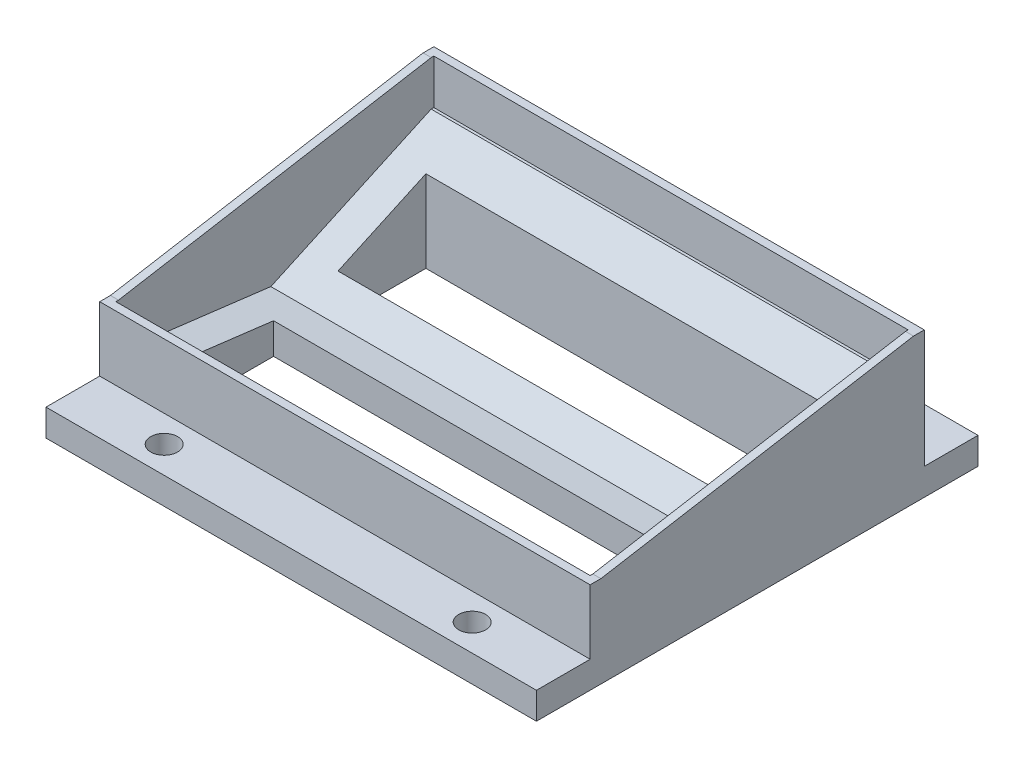
ISO-10303-21;
HEADER;
FILE_DESCRIPTION(('STEP AP214'),'2;1');
FILE_NAME('part.step','',(''),(''),'','','');
FILE_SCHEMA(('AUTOMOTIVE_DESIGN { 1 0 10303 214 1 1 1 1 }'));
ENDSEC;
DATA;
#1=APPLICATION_CONTEXT('core data for automotive mechanical design processes');
#2=APPLICATION_PROTOCOL_DEFINITION('international standard','automotive_design',2000,#1);
#3=PRODUCT_CONTEXT('',#1,'mechanical');
#4=PRODUCT('Part','Part','',(#3));
#5=PRODUCT_RELATED_PRODUCT_CATEGORY('part','',(#4));
#6=PRODUCT_DEFINITION_FORMATION('','',#4);
#7=PRODUCT_DEFINITION_CONTEXT('part definition',#1,'design');
#8=PRODUCT_DEFINITION('design','',#6,#7);
#9=PRODUCT_DEFINITION_SHAPE('','',#8);
#10=(LENGTH_UNIT() NAMED_UNIT(*) SI_UNIT(.MILLI.,.METRE.));
#11=(NAMED_UNIT(*) PLANE_ANGLE_UNIT() SI_UNIT($,.RADIAN.));
#12=(NAMED_UNIT(*) SI_UNIT($,.STERADIAN.) SOLID_ANGLE_UNIT());
#13=UNCERTAINTY_MEASURE_WITH_UNIT(LENGTH_MEASURE(1.E-05),#10,'distance_accuracy_value','');
#14=(GEOMETRIC_REPRESENTATION_CONTEXT(3) GLOBAL_UNCERTAINTY_ASSIGNED_CONTEXT((#13)) GLOBAL_UNIT_ASSIGNED_CONTEXT((#10,
#11,#12)) REPRESENTATION_CONTEXT('',''));
#15=CARTESIAN_POINT('',(0.,0.,0.));
#16=DIRECTION('',(0.,0.,1.));
#17=DIRECTION('',(1.,0.,0.));
#18=AXIS2_PLACEMENT_3D('',#15,#16,#17);
#19=CARTESIAN_POINT('',(87.3,30.4641625968709,101.911459735125));
#20=DIRECTION('',(0.,-0.992396519437702,0.12308187603354));
#21=DIRECTION('',(0.,-0.12308187603354,-0.992396519437702));
#22=AXIS2_PLACEMENT_3D('',#19,#20,#21);
#23=PLANE('',#22);
#24=DIRECTION('',(0.,0.12308187603354,0.992396519437702));
#25=VECTOR('',#24,1.);
#26=CARTESIAN_POINT('',(81.3,30.4641625968709,101.911459735125));
#27=LINE('',#26,#25);
#28=CARTESIAN_POINT('',(81.3,27.690965901593,79.5514597351249));
#29=VERTEX_POINT('',#28);
#30=CARTESIAN_POINT('',(81.3,29.7200132153115,95.9114597351249));
#31=VERTEX_POINT('',#30);
#32=EDGE_CURVE('E399',#29,#31,#27,.T.);
#33=ORIENTED_EDGE('',*,*,#32,.T.);
#34=DIRECTION('',(-1.,0.,0.));
#35=VECTOR('',#34,1.);
#36=CARTESIAN_POINT('',(87.3,29.7200132153115,95.9114597351249));
#37=LINE('',#36,#35);
#38=CARTESIAN_POINT('',(6.00000000000001,29.7200132153115,95.9114597351248));
#39=VERTEX_POINT('',#38);
#40=EDGE_CURVE('E402',#31,#39,#37,.T.);
#41=ORIENTED_EDGE('',*,*,#40,.T.);
#42=DIRECTION('',(0.,-0.12308187603354,-0.992396519437702));
#43=VECTOR('',#42,1.);
#44=CARTESIAN_POINT('',(6.00000000000001,30.4641625968709,101.911459735125));
#45=LINE('',#44,#43);
#46=CARTESIAN_POINT('',(6.,27.690965901593,79.5514597351249));
#47=VERTEX_POINT('',#46);
#48=EDGE_CURVE('E387',#39,#47,#45,.T.);
#49=ORIENTED_EDGE('',*,*,#48,.T.);
#50=DIRECTION('',(1.,0.,0.));
#51=VECTOR('',#50,1.);
#52=CARTESIAN_POINT('',(87.3,27.690965901593,79.5514597351249));
#53=LINE('',#52,#51);
#54=EDGE_CURVE('E396',#47,#29,#53,.T.);
#55=ORIENTED_EDGE('',*,*,#54,.T.);
#56=EDGE_LOOP('',(#33,#41,#49,#55));
#57=FACE_BOUND('',#56,.T.);
#58=DIRECTION('',(-1.,0.,0.));
#59=VECTOR('',#58,1.);
#60=CARTESIAN_POINT('',(87.3,26.9468165200336,73.5514597351249));
#61=LINE('',#60,#59);
#62=CARTESIAN_POINT('',(87.8,26.9468165200336,73.5514597351249));
#63=VERTEX_POINT('',#62);
#64=CARTESIAN_POINT('',(-0.5,26.9468165200336,73.5514597351249));
#65=VERTEX_POINT('',#64);
#66=EDGE_CURVE('E429',#63,#65,#61,.T.);
#67=ORIENTED_EDGE('',*,*,#66,.T.);
#68=DIRECTION('',(0.,-0.12308187603354,-0.992396519437702));
#69=VECTOR('',#68,1.);
#70=CARTESIAN_POINT('',(-0.5,26.9468165200336,73.5514597351249));
#71=LINE('',#70,#69);
#72=CARTESIAN_POINT('',(-0.5,30.4641625968709,101.911459735125));
#73=VERTEX_POINT('',#72);
#74=EDGE_CURVE('E276',#73,#65,#71,.T.);
#75=ORIENTED_EDGE('',*,*,#74,.F.);
#76=DIRECTION('',(-1.,0.,0.));
#77=VECTOR('',#76,1.);
#78=CARTESIAN_POINT('',(87.3,30.4641625968709,101.911459735125));
#79=LINE('',#78,#77);
#80=CARTESIAN_POINT('',(87.8,30.4641625968709,101.911459735125));
#81=VERTEX_POINT('',#80);
#82=EDGE_CURVE('E442',#81,#73,#79,.T.);
#83=ORIENTED_EDGE('',*,*,#82,.F.);
#84=DIRECTION('',(0.,0.12308187603354,0.992396519437702));
#85=VECTOR('',#84,1.);
#86=CARTESIAN_POINT('',(87.8,30.4641625968709,101.911459735125));
#87=LINE('',#86,#85);
#88=EDGE_CURVE('E269',#63,#81,#87,.T.);
#89=ORIENTED_EDGE('',*,*,#88,.F.);
#90=EDGE_LOOP('',(#67,#75,#83,#89));
#91=FACE_BOUND('',#90,.T.);
#92=ADVANCED_FACE('F33',(#57,#91),#23,.F.);
#93=CARTESIAN_POINT('',(87.3,26.9468165200336,113.911459735125));
#94=DIRECTION('',(0.,-1.,0.));
#95=DIRECTION('',(0.,0.,-1.));
#96=AXIS2_PLACEMENT_3D('',#93,#94,#95);
#97=PLANE('',#96);
#98=CARTESIAN_POINT('',(15.0000000000008,26.9468165200336,108.911459735125));
#99=DIRECTION('',(0.,1.,0.));
#100=DIRECTION('',(0.,0.,1.));
#101=AXIS2_PLACEMENT_3D('',#98,#99,#100);
#102=CIRCLE('',#101,2.5);
#103=CARTESIAN_POINT('',(15.0000000000008,26.9468165200336,111.411459735125));
#104=VERTEX_POINT('',#103);
#105=EDGE_CURVE('E405',#104,#104,#102,.T.);
#106=ORIENTED_EDGE('',*,*,#105,.F.);
#107=EDGE_LOOP('',(#106));
#108=FACE_BOUND('',#107,.T.);
#109=CARTESIAN_POINT('',(72.333370452905,26.9468165200336,108.911459735125));
#110=DIRECTION('',(0.,1.,0.));
#111=DIRECTION('',(0.,0.,1.));
#112=AXIS2_PLACEMENT_3D('',#109,#110,#111);
#113=CIRCLE('',#112,2.5);
#114=CARTESIAN_POINT('',(72.333370452905,26.9468165200336,111.411459735125));
#115=VERTEX_POINT('',#114);
#116=EDGE_CURVE('E411',#115,#115,#113,.T.);
#117=ORIENTED_EDGE('',*,*,#116,.F.);
#118=EDGE_LOOP('',(#117));
#119=FACE_BOUND('',#118,.T.);
#120=DIRECTION('',(-1.,0.,0.));
#121=VECTOR('',#120,1.);
#122=CARTESIAN_POINT('',(87.3,26.9468165200336,113.911459735125));
#123=LINE('',#122,#121);
#124=CARTESIAN_POINT('',(89.3,26.9468165200336,113.911459735125));
#125=VERTEX_POINT('',#124);
#126=CARTESIAN_POINT('',(-1.99999999999999,26.9468165200336,113.911459735125));
#127=VERTEX_POINT('',#126);
#128=EDGE_CURVE('E440',#125,#127,#123,.T.);
#129=ORIENTED_EDGE('',*,*,#128,.F.);
#130=DIRECTION('',(0.,0.,1.));
#131=VECTOR('',#130,1.);
#132=CARTESIAN_POINT('',(89.3,26.9468165200336,113.911459735125));
#133=LINE('',#132,#131);
#134=CARTESIAN_POINT('',(89.3,26.9468165200336,103.911459735125));
#135=VERTEX_POINT('',#134);
#136=EDGE_CURVE('E319',#135,#125,#133,.T.);
#137=ORIENTED_EDGE('',*,*,#136,.F.);
#138=DIRECTION('',(1.,0.,0.));
#139=VECTOR('',#138,1.);
#140=CARTESIAN_POINT('',(0.,26.9468165200336,103.911459735125));
#141=LINE('',#140,#139);
#142=CARTESIAN_POINT('',(-1.99999999999999,26.9468165200336,103.911459735125));
#143=VERTEX_POINT('',#142);
#144=EDGE_CURVE('E354',#143,#135,#141,.T.);
#145=ORIENTED_EDGE('',*,*,#144,.F.);
#146=DIRECTION('',(0.,0.,1.));
#147=VECTOR('',#146,1.);
#148=CARTESIAN_POINT('',(-1.99999999999999,26.9468165200336,113.911459735125));
#149=LINE('',#148,#147);
#150=EDGE_CURVE('E285',#143,#127,#149,.T.);
#151=ORIENTED_EDGE('',*,*,#150,.T.);
#152=EDGE_LOOP('',(#129,#137,#145,#151));
#153=FACE_BOUND('',#152,.T.);
#154=ADVANCED_FACE('F482',(#108,#119,#153),#97,.F.);
#155=CARTESIAN_POINT('',(87.3,21.9468165200336,113.911459735125));
#156=DIRECTION('',(0.,0.,-1.));
#157=DIRECTION('',(-1.,0.,0.));
#158=AXIS2_PLACEMENT_3D('',#155,#156,#157);
#159=PLANE('',#158);
#160=ORIENTED_EDGE('',*,*,#128,.T.);
#161=DIRECTION('',(0.,-1.,0.));
#162=VECTOR('',#161,1.);
#163=CARTESIAN_POINT('',(-1.99999999999999,21.9468165200336,113.911459735125));
#164=LINE('',#163,#162);
#165=CARTESIAN_POINT('',(-1.99999999999999,21.9468165200336,113.911459735125));
#166=VERTEX_POINT('',#165);
#167=EDGE_CURVE('E288',#127,#166,#164,.T.);
#168=ORIENTED_EDGE('',*,*,#167,.T.);
#169=DIRECTION('',(-1.,0.,0.));
#170=VECTOR('',#169,1.);
#171=CARTESIAN_POINT('',(87.3,21.9468165200336,113.911459735125));
#172=LINE('',#171,#170);
#173=CARTESIAN_POINT('',(89.3,21.9468165200336,113.911459735125));
#174=VERTEX_POINT('',#173);
#175=EDGE_CURVE('E438',#174,#166,#172,.T.);
#176=ORIENTED_EDGE('',*,*,#175,.F.);
#177=DIRECTION('',(0.,-1.,0.));
#178=VECTOR('',#177,1.);
#179=CARTESIAN_POINT('',(89.3,21.9468165200336,113.911459735125));
#180=LINE('',#179,#178);
#181=EDGE_CURVE('E322',#125,#174,#180,.T.);
#182=ORIENTED_EDGE('',*,*,#181,.F.);
#183=EDGE_LOOP('',(#160,#168,#176,#182));
#184=FACE_BOUND('',#183,.T.);
#185=ADVANCED_FACE('F488',(#184),#159,.F.);
#186=CARTESIAN_POINT('',(87.3,21.9468165200336,31.7114597351249));
#187=DIRECTION('',(0.,1.,0.));
#188=DIRECTION('',(0.,0.,1.));
#189=AXIS2_PLACEMENT_3D('',#186,#187,#188);
#190=PLANE('',#189);
#191=DIRECTION('',(-1.,0.,0.));
#192=VECTOR('',#191,1.);
#193=CARTESIAN_POINT('',(6.,21.9468165200336,67.5514597351249));
#194=LINE('',#193,#192);
#195=CARTESIAN_POINT('',(81.3,21.9468165200336,67.5514597351249));
#196=VERTEX_POINT('',#195);
#197=CARTESIAN_POINT('',(6.,21.9468165200336,67.5514597351249));
#198=VERTEX_POINT('',#197);
#199=EDGE_CURVE('E358',#196,#198,#194,.T.);
#200=ORIENTED_EDGE('',*,*,#199,.F.);
#201=DIRECTION('',(0.,0.,1.));
#202=VECTOR('',#201,1.);
#203=CARTESIAN_POINT('',(81.3,21.9468165200336,67.5514597351249));
#204=LINE('',#203,#202);
#205=CARTESIAN_POINT('',(81.3,21.9468165200336,51.1914597351249));
#206=VERTEX_POINT('',#205);
#207=EDGE_CURVE('E47',#206,#196,#204,.T.);
#208=ORIENTED_EDGE('',*,*,#207,.F.);
#209=DIRECTION('',(1.,0.,0.));
#210=VECTOR('',#209,1.);
#211=CARTESIAN_POINT('',(81.3,21.9468165200336,51.1914597351249));
#212=LINE('',#211,#210);
#213=CARTESIAN_POINT('',(6.00000000000001,21.9468165200336,51.1914597351249));
#214=VERTEX_POINT('',#213);
#215=EDGE_CURVE('E363',#214,#206,#212,.T.);
#216=ORIENTED_EDGE('',*,*,#215,.F.);
#217=DIRECTION('',(0.,0.,-1.));
#218=VECTOR('',#217,1.);
#219=CARTESIAN_POINT('',(6.00000000000001,21.9468165200336,51.1914597351249));
#220=LINE('',#219,#218);
#221=EDGE_CURVE('E360',#198,#214,#220,.T.);
#222=ORIENTED_EDGE('',*,*,#221,.F.);
#223=EDGE_LOOP('',(#200,#208,#216,#222));
#224=FACE_BOUND('',#223,.T.);
#225=DIRECTION('',(0.,0.,-1.));
#226=VECTOR('',#225,1.);
#227=CARTESIAN_POINT('',(6.00000000000001,21.9468165200336,95.9114597351248));
#228=LINE('',#227,#226);
#229=CARTESIAN_POINT('',(6.,21.9468165200336,95.9114597351248));
#230=VERTEX_POINT('',#229);
#231=CARTESIAN_POINT('',(6.,21.9468165200336,79.5514597351249));
#232=VERTEX_POINT('',#231);
#233=EDGE_CURVE('E375',#230,#232,#228,.T.);
#234=ORIENTED_EDGE('',*,*,#233,.F.);
#235=DIRECTION('',(-1.,0.,0.));
#236=VECTOR('',#235,1.);
#237=CARTESIAN_POINT('',(81.3,21.9468165200336,95.9114597351249));
#238=LINE('',#237,#236);
#239=CARTESIAN_POINT('',(81.3,21.9468165200336,95.9114597351249));
#240=VERTEX_POINT('',#239);
#241=EDGE_CURVE('E369',#240,#230,#238,.T.);
#242=ORIENTED_EDGE('',*,*,#241,.F.);
#243=DIRECTION('',(0.,0.,1.));
#244=VECTOR('',#243,1.);
#245=CARTESIAN_POINT('',(81.3,21.9468165200336,79.5514597351249));
#246=LINE('',#245,#244);
#247=CARTESIAN_POINT('',(81.3,21.9468165200336,79.5514597351249));
#248=VERTEX_POINT('',#247);
#249=EDGE_CURVE('E381',#248,#240,#246,.T.);
#250=ORIENTED_EDGE('',*,*,#249,.F.);
#251=DIRECTION('',(1.,0.,0.));
#252=VECTOR('',#251,1.);
#253=CARTESIAN_POINT('',(6.,21.9468165200336,79.5514597351249));
#254=LINE('',#253,#252);
#255=EDGE_CURVE('E378',#232,#248,#254,.T.);
#256=ORIENTED_EDGE('',*,*,#255,.F.);
#257=EDGE_LOOP('',(#234,#242,#250,#256));
#258=FACE_BOUND('',#257,.T.);
#259=CARTESIAN_POINT('',(15.0000000000008,21.9468165200336,108.911459735125));
#260=DIRECTION('',(0.,1.,0.));
#261=DIRECTION('',(0.,0.,1.));
#262=AXIS2_PLACEMENT_3D('',#259,#260,#261);
#263=CIRCLE('',#262,2.5);
#264=CARTESIAN_POINT('',(15.0000000000008,21.9468165200336,111.411459735125));
#265=VERTEX_POINT('',#264);
#266=EDGE_CURVE('E408',#265,#265,#263,.F.);
#267=ORIENTED_EDGE('',*,*,#266,.F.);
#268=EDGE_LOOP('',(#267));
#269=FACE_BOUND('',#268,.T.);
#270=CARTESIAN_POINT('',(72.333370452905,21.9468165200336,108.911459735125));
#271=DIRECTION('',(0.,1.,0.));
#272=DIRECTION('',(0.,0.,1.));
#273=AXIS2_PLACEMENT_3D('',#270,#271,#272);
#274=CIRCLE('',#273,2.5);
#275=CARTESIAN_POINT('',(72.333370452905,21.9468165200336,111.411459735125));
#276=VERTEX_POINT('',#275);
#277=EDGE_CURVE('E414',#276,#276,#274,.F.);
#278=ORIENTED_EDGE('',*,*,#277,.F.);
#279=EDGE_LOOP('',(#278));
#280=FACE_BOUND('',#279,.T.);
#281=CARTESIAN_POINT('',(72.3333704529042,21.9468165200336,36.7114597351249));
#282=DIRECTION('',(0.,1.,0.));
#283=DIRECTION('',(0.,0.,1.));
#284=AXIS2_PLACEMENT_3D('',#281,#282,#283);
#285=CIRCLE('',#284,2.50000000000001);
#286=CARTESIAN_POINT('',(72.3333704529042,21.9468165200336,39.2114597351249));
#287=VERTEX_POINT('',#286);
#288=EDGE_CURVE('E420',#287,#287,#285,.F.);
#289=ORIENTED_EDGE('',*,*,#288,.F.);
#290=EDGE_LOOP('',(#289));
#291=FACE_BOUND('',#290,.T.);
#292=CARTESIAN_POINT('',(15.,21.9468165200336,36.7114597351249));
#293=DIRECTION('',(0.,1.,0.));
#294=DIRECTION('',(0.,0.,1.));
#295=AXIS2_PLACEMENT_3D('',#292,#293,#294);
#296=CIRCLE('',#295,2.5);
#297=CARTESIAN_POINT('',(15.,21.9468165200336,39.2114597351249));
#298=VERTEX_POINT('',#297);
#299=EDGE_CURVE('E426',#298,#298,#296,.F.);
#300=ORIENTED_EDGE('',*,*,#299,.F.);
#301=EDGE_LOOP('',(#300));
#302=FACE_BOUND('',#301,.T.);
#303=ORIENTED_EDGE('',*,*,#175,.T.);
#304=DIRECTION('',(0.,0.,-1.));
#305=VECTOR('',#304,1.);
#306=CARTESIAN_POINT('',(-1.99999999999999,21.9468165200336,31.7114597351249));
#307=LINE('',#306,#305);
#308=CARTESIAN_POINT('',(-1.99999999999999,21.9468165200336,31.7114597351249));
#309=VERTEX_POINT('',#308);
#310=EDGE_CURVE('E291',#166,#309,#307,.T.);
#311=ORIENTED_EDGE('',*,*,#310,.T.);
#312=DIRECTION('',(-1.,0.,0.));
#313=VECTOR('',#312,1.);
#314=CARTESIAN_POINT('',(87.3,21.9468165200336,31.7114597351249));
#315=LINE('',#314,#313);
#316=CARTESIAN_POINT('',(89.3,21.9468165200336,31.7114597351249));
#317=VERTEX_POINT('',#316);
#318=EDGE_CURVE('E436',#317,#309,#315,.T.);
#319=ORIENTED_EDGE('',*,*,#318,.F.);
#320=DIRECTION('',(0.,0.,-1.));
#321=VECTOR('',#320,1.);
#322=CARTESIAN_POINT('',(89.3,21.9468165200336,31.7114597351249));
#323=LINE('',#322,#321);
#324=EDGE_CURVE('E325',#174,#317,#323,.T.);
#325=ORIENTED_EDGE('',*,*,#324,.F.);
#326=EDGE_LOOP('',(#303,#311,#319,#325));
#327=FACE_BOUND('',#326,.T.);
#328=ADVANCED_FACE('F464',(#224,#258,#269,#280,#291,#302,#327),#190,.F.);
#329=CARTESIAN_POINT('',(87.3,26.9468165200336,31.7114597351249));
#330=DIRECTION('',(0.,0.,1.));
#331=DIRECTION('',(1.,0.,0.));
#332=AXIS2_PLACEMENT_3D('',#329,#330,#331);
#333=PLANE('',#332);
#334=ORIENTED_EDGE('',*,*,#318,.T.);
#335=DIRECTION('',(0.,1.,0.));
#336=VECTOR('',#335,1.);
#337=CARTESIAN_POINT('',(-1.99999999999999,26.9468165200336,31.7114597351249));
#338=LINE('',#337,#336);
#339=CARTESIAN_POINT('',(-1.99999999999999,26.9468165200336,31.7114597351249));
#340=VERTEX_POINT('',#339);
#341=EDGE_CURVE('E294',#309,#340,#338,.T.);
#342=ORIENTED_EDGE('',*,*,#341,.T.);
#343=DIRECTION('',(-1.,0.,0.));
#344=VECTOR('',#343,1.);
#345=CARTESIAN_POINT('',(87.3,26.9468165200336,31.7114597351249));
#346=LINE('',#345,#344);
#347=CARTESIAN_POINT('',(89.3,26.9468165200336,31.7114597351249));
#348=VERTEX_POINT('',#347);
#349=EDGE_CURVE('E434',#348,#340,#346,.T.);
#350=ORIENTED_EDGE('',*,*,#349,.F.);
#351=DIRECTION('',(0.,1.,0.));
#352=VECTOR('',#351,1.);
#353=CARTESIAN_POINT('',(89.3,26.9468165200336,31.7114597351249));
#354=LINE('',#353,#352);
#355=EDGE_CURVE('E328',#317,#348,#354,.T.);
#356=ORIENTED_EDGE('',*,*,#355,.F.);
#357=EDGE_LOOP('',(#334,#342,#350,#356));
#358=FACE_BOUND('',#357,.T.);
#359=ADVANCED_FACE('F542',(#358),#333,.F.);
#360=CARTESIAN_POINT('',(87.3,26.9468165200336,43.7114597351249));
#361=DIRECTION('',(0.,-1.,0.));
#362=DIRECTION('',(0.,0.,-1.));
#363=AXIS2_PLACEMENT_3D('',#360,#361,#362);
#364=PLANE('',#363);
#365=CARTESIAN_POINT('',(72.3333704529042,26.9468165200336,36.7114597351249));
#366=DIRECTION('',(0.,1.,0.));
#367=DIRECTION('',(0.,0.,1.));
#368=AXIS2_PLACEMENT_3D('',#365,#366,#367);
#369=CIRCLE('',#368,2.50000000000001);
#370=CARTESIAN_POINT('',(72.3333704529042,26.9468165200336,39.2114597351249));
#371=VERTEX_POINT('',#370);
#372=EDGE_CURVE('E417',#371,#371,#369,.T.);
#373=ORIENTED_EDGE('',*,*,#372,.F.);
#374=EDGE_LOOP('',(#373));
#375=FACE_BOUND('',#374,.T.);
#376=CARTESIAN_POINT('',(15.,26.9468165200336,36.7114597351249));
#377=DIRECTION('',(0.,1.,0.));
#378=DIRECTION('',(0.,0.,1.));
#379=AXIS2_PLACEMENT_3D('',#376,#377,#378);
#380=CIRCLE('',#379,2.5);
#381=CARTESIAN_POINT('',(15.,26.9468165200336,39.2114597351249));
#382=VERTEX_POINT('',#381);
#383=EDGE_CURVE('E423',#382,#382,#380,.T.);
#384=ORIENTED_EDGE('',*,*,#383,.F.);
#385=EDGE_LOOP('',(#384));
#386=FACE_BOUND('',#385,.T.);
#387=ORIENTED_EDGE('',*,*,#349,.T.);
#388=DIRECTION('',(0.,0.,1.));
#389=VECTOR('',#388,1.);
#390=CARTESIAN_POINT('',(-1.99999999999999,26.9468165200336,41.7114597351249));
#391=LINE('',#390,#389);
#392=CARTESIAN_POINT('',(-1.99999999999999,26.9468165200336,41.7114597351249));
#393=VERTEX_POINT('',#392);
#394=EDGE_CURVE('E297',#340,#393,#391,.T.);
#395=ORIENTED_EDGE('',*,*,#394,.T.);
#396=DIRECTION('',(1.,0.,0.));
#397=VECTOR('',#396,1.);
#398=CARTESIAN_POINT('',(0.,26.9468165200336,41.7114597351249));
#399=LINE('',#398,#397);
#400=CARTESIAN_POINT('',(89.3,26.9468165200336,41.7114597351249));
#401=VERTEX_POINT('',#400);
#402=EDGE_CURVE('E349',#393,#401,#399,.T.);
#403=ORIENTED_EDGE('',*,*,#402,.T.);
#404=DIRECTION('',(0.,0.,1.));
#405=VECTOR('',#404,1.);
#406=CARTESIAN_POINT('',(89.3,26.9468165200336,41.7114597351249));
#407=LINE('',#406,#405);
#408=EDGE_CURVE('E331',#348,#401,#407,.T.);
#409=ORIENTED_EDGE('',*,*,#408,.F.);
#410=EDGE_LOOP('',(#387,#395,#403,#409));
#411=FACE_BOUND('',#410,.T.);
#412=ADVANCED_FACE('F545',(#375,#386,#411),#364,.F.);
#413=CARTESIAN_POINT('',(87.3,26.9468165200336,73.5514597351249));
#414=DIRECTION('',(0.,-0.908872489359864,-0.417074091840772));
#415=DIRECTION('',(0.,0.417074091840772,-0.908872489359864));
#416=AXIS2_PLACEMENT_3D('',#413,#414,#415);
#417=PLANE('',#416);
#418=DIRECTION('',(1.,0.,0.));
#419=VECTOR('',#418,1.);
#420=CARTESIAN_POINT('',(87.3,37.2076361649631,51.1914597351249));
#421=LINE('',#420,#419);
#422=CARTESIAN_POINT('',(6.00000000000001,37.2076361649631,51.1914597351249));
#423=VERTEX_POINT('',#422);
#424=CARTESIAN_POINT('',(81.3,37.2076361649631,51.1914597351249));
#425=VERTEX_POINT('',#424);
#426=EDGE_CURVE('E40',#423,#425,#421,.T.);
#427=ORIENTED_EDGE('',*,*,#426,.T.);
#428=DIRECTION('',(0.,-0.417074091840772,0.908872489359864));
#429=VECTOR('',#428,1.);
#430=CARTESIAN_POINT('',(81.3,26.9468165200336,73.5514597351249));
#431=LINE('',#430,#429);
#432=CARTESIAN_POINT('',(81.3,29.7001670508734,67.5514597351249));
#433=VERTEX_POINT('',#432);
#434=EDGE_CURVE('E11',#425,#433,#431,.T.);
#435=ORIENTED_EDGE('',*,*,#434,.T.);
#436=DIRECTION('',(-1.,0.,0.));
#437=VECTOR('',#436,1.);
#438=CARTESIAN_POINT('',(87.3,29.7001670508734,67.5514597351249));
#439=LINE('',#438,#437);
#440=CARTESIAN_POINT('',(6.00000000000001,29.7001670508734,67.5514597351249));
#441=VERTEX_POINT('',#440);
#442=EDGE_CURVE('E445',#433,#441,#439,.T.);
#443=ORIENTED_EDGE('',*,*,#442,.T.);
#444=DIRECTION('',(0.,0.417074091840772,-0.908872489359864));
#445=VECTOR('',#444,1.);
#446=CARTESIAN_POINT('',(6.00000000000001,26.9468165200336,73.5514597351249));
#447=LINE('',#446,#445);
#448=EDGE_CURVE('E448',#441,#423,#447,.T.);
#449=ORIENTED_EDGE('',*,*,#448,.T.);
#450=EDGE_LOOP('',(#427,#435,#443,#449));
#451=FACE_BOUND('',#450,.T.);
#452=DIRECTION('',(-1.,0.,0.));
#453=VECTOR('',#452,1.);
#454=CARTESIAN_POINT('',(87.3,40.64014649341,43.7114597351249));
#455=LINE('',#454,#453);
#456=CARTESIAN_POINT('',(87.8,40.64014649341,43.7114597351249));
#457=VERTEX_POINT('',#456);
#458=CARTESIAN_POINT('',(-0.5,40.64014649341,43.7114597351249));
#459=VERTEX_POINT('',#458);
#460=EDGE_CURVE('E431',#457,#459,#455,.T.);
#461=ORIENTED_EDGE('',*,*,#460,.T.);
#462=DIRECTION('',(0.,0.417074091840772,-0.908872489359864));
#463=VECTOR('',#462,1.);
#464=CARTESIAN_POINT('',(-0.5,40.64014649341,43.7114597351249));
#465=LINE('',#464,#463);
#466=EDGE_CURVE('E279',#65,#459,#465,.T.);
#467=ORIENTED_EDGE('',*,*,#466,.F.);
#468=ORIENTED_EDGE('',*,*,#66,.F.);
#469=DIRECTION('',(0.,-0.417074091840772,0.908872489359864));
#470=VECTOR('',#469,1.);
#471=CARTESIAN_POINT('',(87.8,26.9468165200336,73.5514597351249));
#472=LINE('',#471,#470);
#473=EDGE_CURVE('E260',#457,#63,#472,.T.);
#474=ORIENTED_EDGE('',*,*,#473,.F.);
#475=EDGE_LOOP('',(#461,#467,#468,#474));
#476=FACE_BOUND('',#475,.T.);
#477=ADVANCED_FACE('F452',(#451,#476),#417,.F.);
#478=CARTESIAN_POINT('',(15.,21.9458165200336,36.7114597351249));
#479=DIRECTION('',(0.,1.,0.));
#480=DIRECTION('',(0.,0.,1.));
#481=AXIS2_PLACEMENT_3D('',#478,#479,#480);
#482=CYLINDRICAL_SURFACE('',#481,2.5);
#483=ORIENTED_EDGE('',*,*,#383,.T.);
#484=EDGE_LOOP('',(#483));
#485=FACE_BOUND('',#484,.T.);
#486=ORIENTED_EDGE('',*,*,#299,.T.);
#487=EDGE_LOOP('',(#486));
#488=FACE_BOUND('',#487,.T.);
#489=ADVANCED_FACE('F644',(#485,#488),#482,.F.);
#490=CARTESIAN_POINT('',(72.3333704529042,21.9458165200336,36.7114597351249));
#491=DIRECTION('',(0.,1.,0.));
#492=DIRECTION('',(0.,0.,1.));
#493=AXIS2_PLACEMENT_3D('',#490,#491,#492);
#494=CYLINDRICAL_SURFACE('',#493,2.50000000000001);
#495=ORIENTED_EDGE('',*,*,#372,.T.);
#496=EDGE_LOOP('',(#495));
#497=FACE_BOUND('',#496,.T.);
#498=ORIENTED_EDGE('',*,*,#288,.T.);
#499=EDGE_LOOP('',(#498));
#500=FACE_BOUND('',#499,.T.);
#501=ADVANCED_FACE('F634',(#497,#500),#494,.F.);
#502=CARTESIAN_POINT('',(72.333370452905,21.9458165200336,108.911459735125));
#503=DIRECTION('',(0.,1.,0.));
#504=DIRECTION('',(0.,0.,1.));
#505=AXIS2_PLACEMENT_3D('',#502,#503,#504);
#506=CYLINDRICAL_SURFACE('',#505,2.5);
#507=ORIENTED_EDGE('',*,*,#116,.T.);
#508=EDGE_LOOP('',(#507));
#509=FACE_BOUND('',#508,.T.);
#510=ORIENTED_EDGE('',*,*,#277,.T.);
#511=EDGE_LOOP('',(#510));
#512=FACE_BOUND('',#511,.T.);
#513=ADVANCED_FACE('F624',(#509,#512),#506,.F.);
#514=CARTESIAN_POINT('',(15.0000000000008,21.9458165200336,108.911459735125));
#515=DIRECTION('',(0.,1.,0.));
#516=DIRECTION('',(0.,0.,1.));
#517=AXIS2_PLACEMENT_3D('',#514,#515,#516);
#518=CYLINDRICAL_SURFACE('',#517,2.5);
#519=ORIENTED_EDGE('',*,*,#105,.T.);
#520=EDGE_LOOP('',(#519));
#521=FACE_BOUND('',#520,.T.);
#522=ORIENTED_EDGE('',*,*,#266,.T.);
#523=EDGE_LOOP('',(#522));
#524=FACE_BOUND('',#523,.T.);
#525=ADVANCED_FACE('F614',(#521,#524),#518,.F.);
#526=CARTESIAN_POINT('',(81.3,40.64014649341,95.9114597351249));
#527=DIRECTION('',(0.,0.,1.));
#528=DIRECTION('',(0.,-1.,0.));
#529=AXIS2_PLACEMENT_3D('',#526,#527,#528);
#530=PLANE('',#529);
#531=DIRECTION('',(0.,-1.,0.));
#532=VECTOR('',#531,1.);
#533=CARTESIAN_POINT('',(81.3,40.64014649341,95.9114597351249));
#534=LINE('',#533,#532);
#535=EDGE_CURVE('E385',#31,#240,#534,.T.);
#536=ORIENTED_EDGE('',*,*,#535,.T.);
#537=ORIENTED_EDGE('',*,*,#241,.T.);
#538=DIRECTION('',(0.,-1.,0.));
#539=VECTOR('',#538,1.);
#540=CARTESIAN_POINT('',(6.00000000000001,40.64014649341,95.9114597351248));
#541=LINE('',#540,#539);
#542=EDGE_CURVE('E384',#39,#230,#541,.T.);
#543=ORIENTED_EDGE('',*,*,#542,.F.);
#544=ORIENTED_EDGE('',*,*,#40,.F.);
#545=EDGE_LOOP('',(#536,#537,#543,#544));
#546=FACE_BOUND('',#545,.T.);
#547=ADVANCED_FACE('F605',(#546),#530,.F.);
#548=CARTESIAN_POINT('',(81.3,40.64014649341,79.5514597351249));
#549=DIRECTION('',(1.,0.,0.));
#550=DIRECTION('',(0.,0.,-1.));
#551=AXIS2_PLACEMENT_3D('',#548,#549,#550);
#552=PLANE('',#551);
#553=DIRECTION('',(0.,-1.,0.));
#554=VECTOR('',#553,1.);
#555=CARTESIAN_POINT('',(81.3,40.64014649341,79.5514597351249));
#556=LINE('',#555,#554);
#557=EDGE_CURVE('E388',#29,#248,#556,.T.);
#558=ORIENTED_EDGE('',*,*,#557,.T.);
#559=ORIENTED_EDGE('',*,*,#249,.T.);
#560=ORIENTED_EDGE('',*,*,#535,.F.);
#561=ORIENTED_EDGE('',*,*,#32,.F.);
#562=EDGE_LOOP('',(#558,#559,#560,#561));
#563=FACE_BOUND('',#562,.T.);
#564=ADVANCED_FACE('F595',(#563),#552,.F.);
#565=CARTESIAN_POINT('',(6.,40.64014649341,79.5514597351249));
#566=DIRECTION('',(0.,0.,-1.));
#567=DIRECTION('',(0.,1.,0.));
#568=AXIS2_PLACEMENT_3D('',#565,#566,#567);
#569=PLANE('',#568);
#570=DIRECTION('',(0.,-1.,0.));
#571=VECTOR('',#570,1.);
#572=CARTESIAN_POINT('',(6.,40.64014649341,79.5514597351249));
#573=LINE('',#572,#571);
#574=EDGE_CURVE('E390',#47,#232,#573,.T.);
#575=ORIENTED_EDGE('',*,*,#574,.T.);
#576=ORIENTED_EDGE('',*,*,#255,.T.);
#577=ORIENTED_EDGE('',*,*,#557,.F.);
#578=ORIENTED_EDGE('',*,*,#54,.F.);
#579=EDGE_LOOP('',(#575,#576,#577,#578));
#580=FACE_BOUND('',#579,.T.);
#581=ADVANCED_FACE('F476',(#580),#569,.F.);
#582=CARTESIAN_POINT('',(6.00000000000001,40.64014649341,95.9114597351248));
#583=DIRECTION('',(-1.,0.,0.));
#584=DIRECTION('',(0.,0.,1.));
#585=AXIS2_PLACEMENT_3D('',#582,#583,#584);
#586=PLANE('',#585);
#587=ORIENTED_EDGE('',*,*,#542,.T.);
#588=ORIENTED_EDGE('',*,*,#233,.T.);
#589=ORIENTED_EDGE('',*,*,#574,.F.);
#590=ORIENTED_EDGE('',*,*,#48,.F.);
#591=EDGE_LOOP('',(#587,#588,#589,#590));
#592=FACE_BOUND('',#591,.T.);
#593=ADVANCED_FACE('F469',(#592),#586,.F.);
#594=CARTESIAN_POINT('',(81.3,40.64014649341,67.5514597351249));
#595=DIRECTION('',(1.,0.,0.));
#596=DIRECTION('',(0.,0.,-1.));
#597=AXIS2_PLACEMENT_3D('',#594,#595,#596);
#598=PLANE('',#597);
#599=DIRECTION('',(0.,-1.,0.));
#600=VECTOR('',#599,1.);
#601=CARTESIAN_POINT('',(81.3,40.64014649341,51.1914597351249));
#602=LINE('',#601,#600);
#603=EDGE_CURVE('E367',#425,#206,#602,.T.);
#604=ORIENTED_EDGE('',*,*,#603,.T.);
#605=ORIENTED_EDGE('',*,*,#207,.T.);
#606=DIRECTION('',(0.,-1.,0.));
#607=VECTOR('',#606,1.);
#608=CARTESIAN_POINT('',(81.3,40.64014649341,67.5514597351249));
#609=LINE('',#608,#607);
#610=EDGE_CURVE('E366',#433,#196,#609,.T.);
#611=ORIENTED_EDGE('',*,*,#610,.F.);
#612=ORIENTED_EDGE('',*,*,#434,.F.);
#613=EDGE_LOOP('',(#604,#605,#611,#612));
#614=FACE_BOUND('',#613,.T.);
#615=ADVANCED_FACE('F467',(#614),#598,.F.);
#616=CARTESIAN_POINT('',(81.3,40.64014649341,51.1914597351249));
#617=DIRECTION('',(0.,0.,-1.));
#618=DIRECTION('',(0.,1.,0.));
#619=AXIS2_PLACEMENT_3D('',#616,#617,#618);
#620=PLANE('',#619);
#621=DIRECTION('',(0.,-1.,0.));
#622=VECTOR('',#621,1.);
#623=CARTESIAN_POINT('',(6.00000000000001,40.64014649341,51.1914597351249));
#624=LINE('',#623,#622);
#625=EDGE_CURVE('E370',#423,#214,#624,.T.);
#626=ORIENTED_EDGE('',*,*,#625,.T.);
#627=ORIENTED_EDGE('',*,*,#215,.T.);
#628=ORIENTED_EDGE('',*,*,#603,.F.);
#629=ORIENTED_EDGE('',*,*,#426,.F.);
#630=EDGE_LOOP('',(#626,#627,#628,#629));
#631=FACE_BOUND('',#630,.T.);
#632=ADVANCED_FACE('F457',(#631),#620,.F.);
#633=CARTESIAN_POINT('',(6.00000000000001,40.64014649341,51.1914597351249));
#634=DIRECTION('',(-1.,0.,0.));
#635=DIRECTION('',(0.,0.,1.));
#636=AXIS2_PLACEMENT_3D('',#633,#634,#635);
#637=PLANE('',#636);
#638=DIRECTION('',(0.,-1.,0.));
#639=VECTOR('',#638,1.);
#640=CARTESIAN_POINT('',(6.,40.64014649341,67.5514597351249));
#641=LINE('',#640,#639);
#642=EDGE_CURVE('E55',#441,#198,#641,.T.);
#643=ORIENTED_EDGE('',*,*,#642,.T.);
#644=ORIENTED_EDGE('',*,*,#221,.T.);
#645=ORIENTED_EDGE('',*,*,#625,.F.);
#646=ORIENTED_EDGE('',*,*,#448,.F.);
#647=EDGE_LOOP('',(#643,#644,#645,#646));
#648=FACE_BOUND('',#647,.T.);
#649=ADVANCED_FACE('F459',(#648),#637,.F.);
#650=CARTESIAN_POINT('',(6.,40.64014649341,67.5514597351249));
#651=DIRECTION('',(0.,0.,1.));
#652=DIRECTION('',(0.,-1.,0.));
#653=AXIS2_PLACEMENT_3D('',#650,#651,#652);
#654=PLANE('',#653);
#655=ORIENTED_EDGE('',*,*,#610,.T.);
#656=ORIENTED_EDGE('',*,*,#199,.T.);
#657=ORIENTED_EDGE('',*,*,#642,.F.);
#658=ORIENTED_EDGE('',*,*,#442,.F.);
#659=EDGE_LOOP('',(#655,#656,#657,#658));
#660=FACE_BOUND('',#659,.T.);
#661=ADVANCED_FACE('F466',(#660),#654,.F.);
#662=CARTESIAN_POINT('',(0.,38.9468165200336,103.911459735125));
#663=DIRECTION('',(0.,0.,1.));
#664=DIRECTION('',(1.,0.,0.));
#665=AXIS2_PLACEMENT_3D('',#662,#663,#664);
#666=PLANE('',#665);
#667=ORIENTED_EDGE('',*,*,#144,.T.);
#668=DIRECTION('',(0.,-1.,0.));
#669=VECTOR('',#668,1.);
#670=CARTESIAN_POINT('',(89.3,26.9468165200336,103.911459735125));
#671=LINE('',#670,#669);
#672=CARTESIAN_POINT('',(89.3,38.9468165200336,103.911459735125));
#673=VERTEX_POINT('',#672);
#674=EDGE_CURVE('E316',#673,#135,#671,.T.);
#675=ORIENTED_EDGE('',*,*,#674,.F.);
#676=DIRECTION('',(1.,0.,0.));
#677=VECTOR('',#676,1.);
#678=CARTESIAN_POINT('',(0.,38.9468165200336,103.911459735125));
#679=LINE('',#678,#677);
#680=CARTESIAN_POINT('',(-1.99999999999999,38.9468165200336,103.911459735125));
#681=VERTEX_POINT('',#680);
#682=EDGE_CURVE('E352',#681,#673,#679,.T.);
#683=ORIENTED_EDGE('',*,*,#682,.F.);
#684=DIRECTION('',(0.,-1.,0.));
#685=VECTOR('',#684,1.);
#686=CARTESIAN_POINT('',(-1.99999999999999,26.9468165200336,103.911459735125));
#687=LINE('',#686,#685);
#688=EDGE_CURVE('E282',#681,#143,#687,.T.);
#689=ORIENTED_EDGE('',*,*,#688,.T.);
#690=EDGE_LOOP('',(#667,#675,#683,#689));
#691=FACE_BOUND('',#690,.T.);
#692=ADVANCED_FACE('F529',(#691),#666,.T.);
#693=CARTESIAN_POINT('',(0.,38.9468165200336,101.911459735125));
#694=DIRECTION('',(0.,1.,0.));
#695=DIRECTION('',(0.,0.,1.));
#696=AXIS2_PLACEMENT_3D('',#693,#694,#695);
#697=PLANE('',#696);
#698=DIRECTION('',(0.,0.,-1.));
#699=VECTOR('',#698,1.);
#700=CARTESIAN_POINT('',(-0.5,38.9468165200336,102.411459735125));
#701=LINE('',#700,#699);
#702=CARTESIAN_POINT('',(-0.5,38.9468165200336,102.411459735125));
#703=VERTEX_POINT('',#702);
#704=CARTESIAN_POINT('',(-0.5,38.9468165200336,101.911459735125));
#705=VERTEX_POINT('',#704);
#706=EDGE_CURVE('E212',#703,#705,#701,.T.);
#707=ORIENTED_EDGE('',*,*,#706,.T.);
#708=DIRECTION('',(-1.,0.,0.));
#709=VECTOR('',#708,1.);
#710=CARTESIAN_POINT('',(0.,38.9468165200336,101.911459735125));
#711=LINE('',#710,#709);
#712=CARTESIAN_POINT('',(-1.99999999999999,38.9468165200336,101.911459735125));
#713=VERTEX_POINT('',#712);
#714=EDGE_CURVE('E312',#705,#713,#711,.T.);
#715=ORIENTED_EDGE('',*,*,#714,.T.);
#716=DIRECTION('',(0.,0.,1.));
#717=VECTOR('',#716,1.);
#718=CARTESIAN_POINT('',(-1.99999999999999,38.9468165200336,103.911459735125));
#719=LINE('',#718,#717);
#720=EDGE_CURVE('E309',#713,#681,#719,.T.);
#721=ORIENTED_EDGE('',*,*,#720,.T.);
#722=ORIENTED_EDGE('',*,*,#682,.T.);
#723=DIRECTION('',(0.,0.,1.));
#724=VECTOR('',#723,1.);
#725=CARTESIAN_POINT('',(89.3,38.9468165200336,103.911459735125));
#726=LINE('',#725,#724);
#727=CARTESIAN_POINT('',(89.3,38.9468165200336,101.911459735125));
#728=VERTEX_POINT('',#727);
#729=EDGE_CURVE('E341',#728,#673,#726,.T.);
#730=ORIENTED_EDGE('',*,*,#729,.F.);
#731=DIRECTION('',(-1.,0.,0.));
#732=VECTOR('',#731,1.);
#733=CARTESIAN_POINT('',(89.3,38.9468165200336,101.911459735125));
#734=LINE('',#733,#732);
#735=CARTESIAN_POINT('',(87.8,38.9468165200336,101.911459735125));
#736=VERTEX_POINT('',#735);
#737=EDGE_CURVE('E344',#728,#736,#734,.T.);
#738=ORIENTED_EDGE('',*,*,#737,.T.);
#739=DIRECTION('',(0.,0.,-1.));
#740=VECTOR('',#739,1.);
#741=CARTESIAN_POINT('',(87.8,38.9468165200336,102.411459735125));
#742=LINE('',#741,#740);
#743=CARTESIAN_POINT('',(87.8,38.9468165200336,102.411459735125));
#744=VERTEX_POINT('',#743);
#745=EDGE_CURVE('E222',#744,#736,#742,.T.);
#746=ORIENTED_EDGE('',*,*,#745,.F.);
#747=DIRECTION('',(1.,0.,0.));
#748=VECTOR('',#747,1.);
#749=CARTESIAN_POINT('',(-0.5,38.9468165200336,102.411459735125));
#750=LINE('',#749,#748);
#751=EDGE_CURVE('E229',#703,#744,#750,.T.);
#752=ORIENTED_EDGE('',*,*,#751,.F.);
#753=EDGE_LOOP('',(#707,#715,#721,#722,#730,#738,#746,#752));
#754=FACE_BOUND('',#753,.T.);
#755=ADVANCED_FACE('F233',(#754),#697,.T.);
#756=CARTESIAN_POINT('',(0.,48.9468165200336,43.7114597351249));
#757=DIRECTION('',(0.,1.,0.));
#758=DIRECTION('',(0.,0.,1.));
#759=AXIS2_PLACEMENT_3D('',#756,#757,#758);
#760=PLANE('',#759);
#761=DIRECTION('',(0.,0.,1.));
#762=VECTOR('',#761,1.);
#763=CARTESIAN_POINT('',(87.8,48.9468165200336,43.2114597351249));
#764=LINE('',#763,#762);
#765=CARTESIAN_POINT('',(87.8,48.9468165200336,43.2114597351249));
#766=VERTEX_POINT('',#765);
#767=CARTESIAN_POINT('',(87.8,48.9468165200336,43.7114597351249));
#768=VERTEX_POINT('',#767);
#769=EDGE_CURVE('E258',#766,#768,#764,.T.);
#770=ORIENTED_EDGE('',*,*,#769,.T.);
#771=DIRECTION('',(-1.,0.,0.));
#772=VECTOR('',#771,1.);
#773=CARTESIAN_POINT('',(89.3,48.9468165200336,43.7114597351249));
#774=LINE('',#773,#772);
#775=CARTESIAN_POINT('',(89.3,48.9468165200336,43.7114597351249));
#776=VERTEX_POINT('',#775);
#777=EDGE_CURVE('E346',#776,#768,#774,.T.);
#778=ORIENTED_EDGE('',*,*,#777,.F.);
#779=DIRECTION('',(0.,0.,1.));
#780=VECTOR('',#779,1.);
#781=CARTESIAN_POINT('',(89.3,48.9468165200336,43.7114597351249));
#782=LINE('',#781,#780);
#783=CARTESIAN_POINT('',(89.3,48.9468165200336,41.7114597351249));
#784=VERTEX_POINT('',#783);
#785=EDGE_CURVE('E337',#784,#776,#782,.T.);
#786=ORIENTED_EDGE('',*,*,#785,.F.);
#787=DIRECTION('',(1.,0.,0.));
#788=VECTOR('',#787,1.);
#789=CARTESIAN_POINT('',(0.,48.9468165200336,41.7114597351249));
#790=LINE('',#789,#788);
#791=CARTESIAN_POINT('',(-1.99999999999999,48.9468165200336,41.7114597351249));
#792=VERTEX_POINT('',#791);
#793=EDGE_CURVE('E350',#792,#784,#790,.T.);
#794=ORIENTED_EDGE('',*,*,#793,.F.);
#795=DIRECTION('',(0.,0.,1.));
#796=VECTOR('',#795,1.);
#797=CARTESIAN_POINT('',(-1.99999999999999,48.9468165200336,43.7114597351249));
#798=LINE('',#797,#796);
#799=CARTESIAN_POINT('',(-1.99999999999999,48.9468165200336,43.7114597351249));
#800=VERTEX_POINT('',#799);
#801=EDGE_CURVE('E303',#792,#800,#798,.T.);
#802=ORIENTED_EDGE('',*,*,#801,.T.);
#803=DIRECTION('',(-1.,0.,0.));
#804=VECTOR('',#803,1.);
#805=CARTESIAN_POINT('',(0.,48.9468165200336,43.7114597351249));
#806=LINE('',#805,#804);
#807=CARTESIAN_POINT('',(-0.5,48.9468165200336,43.7114597351249));
#808=VERTEX_POINT('',#807);
#809=EDGE_CURVE('E314',#808,#800,#806,.T.);
#810=ORIENTED_EDGE('',*,*,#809,.F.);
#811=DIRECTION('',(0.,0.,1.));
#812=VECTOR('',#811,1.);
#813=CARTESIAN_POINT('',(-0.5,48.9468165200336,43.2114597351249));
#814=LINE('',#813,#812);
#815=CARTESIAN_POINT('',(-0.5,48.9468165200336,43.2114597351249));
#816=VERTEX_POINT('',#815);
#817=EDGE_CURVE('E257',#816,#808,#814,.T.);
#818=ORIENTED_EDGE('',*,*,#817,.F.);
#819=DIRECTION('',(-1.,0.,0.));
#820=VECTOR('',#819,1.);
#821=CARTESIAN_POINT('',(87.8,48.9468165200336,43.2114597351249));
#822=LINE('',#821,#820);
#823=EDGE_CURVE('E242',#766,#816,#822,.T.);
#824=ORIENTED_EDGE('',*,*,#823,.F.);
#825=EDGE_LOOP('',(#770,#778,#786,#794,#802,#810,#818,#824));
#826=FACE_BOUND('',#825,.T.);
#827=ADVANCED_FACE('F512',(#826),#760,.T.);
#828=CARTESIAN_POINT('',(0.,48.9468165200336,41.7114597351249));
#829=DIRECTION('',(0.,0.,-1.));
#830=DIRECTION('',(-1.,0.,0.));
#831=AXIS2_PLACEMENT_3D('',#828,#829,#830);
#832=PLANE('',#831);
#833=ORIENTED_EDGE('',*,*,#793,.T.);
#834=DIRECTION('',(0.,1.,0.));
#835=VECTOR('',#834,1.);
#836=CARTESIAN_POINT('',(89.3,48.9468165200336,41.7114597351249));
#837=LINE('',#836,#835);
#838=EDGE_CURVE('E334',#401,#784,#837,.T.);
#839=ORIENTED_EDGE('',*,*,#838,.F.);
#840=ORIENTED_EDGE('',*,*,#402,.F.);
#841=DIRECTION('',(0.,1.,0.));
#842=VECTOR('',#841,1.);
#843=CARTESIAN_POINT('',(-1.99999999999999,48.9468165200336,41.7114597351249));
#844=LINE('',#843,#842);
#845=EDGE_CURVE('E300',#393,#792,#844,.T.);
#846=ORIENTED_EDGE('',*,*,#845,.T.);
#847=EDGE_LOOP('',(#833,#839,#840,#846));
#848=FACE_BOUND('',#847,.T.);
#849=ADVANCED_FACE('F548',(#848),#832,.T.);
#850=CARTESIAN_POINT('',(89.3,38.9468165200336,101.911459735125));
#851=DIRECTION('',(0.,-0.985557723841804,-0.169339815093093));
#852=DIRECTION('',(0.,0.169339815093093,-0.985557723841804));
#853=AXIS2_PLACEMENT_3D('',#850,#851,#852);
#854=PLANE('',#853);
#855=ORIENTED_EDGE('',*,*,#777,.T.);
#856=DIRECTION('',(0.,0.169339815093093,-0.985557723841804));
#857=VECTOR('',#856,1.);
#858=CARTESIAN_POINT('',(87.8,48.9468165200336,43.7114597351249));
#859=LINE('',#858,#857);
#860=EDGE_CURVE('E272',#736,#768,#859,.T.);
#861=ORIENTED_EDGE('',*,*,#860,.F.);
#862=ORIENTED_EDGE('',*,*,#737,.F.);
#863=DIRECTION('',(0.,-0.169339815093093,0.985557723841804));
#864=VECTOR('',#863,1.);
#865=CARTESIAN_POINT('',(89.3,38.9468165200336,101.911459735125));
#866=LINE('',#865,#864);
#867=EDGE_CURVE('E339',#776,#728,#866,.T.);
#868=ORIENTED_EDGE('',*,*,#867,.F.);
#869=EDGE_LOOP('',(#855,#861,#862,#868));
#870=FACE_BOUND('',#869,.T.);
#871=ADVANCED_FACE('F550',(#870),#854,.F.);
#872=CARTESIAN_POINT('',(89.3,0.,0.));
#873=DIRECTION('',(-1.,0.,0.));
#874=DIRECTION('',(0.,0.,1.));
#875=AXIS2_PLACEMENT_3D('',#872,#873,#874);
#876=PLANE('',#875);
#877=ORIENTED_EDGE('',*,*,#674,.T.);
#878=ORIENTED_EDGE('',*,*,#136,.T.);
#879=ORIENTED_EDGE('',*,*,#181,.T.);
#880=ORIENTED_EDGE('',*,*,#324,.T.);
#881=ORIENTED_EDGE('',*,*,#355,.T.);
#882=ORIENTED_EDGE('',*,*,#408,.T.);
#883=ORIENTED_EDGE('',*,*,#838,.T.);
#884=ORIENTED_EDGE('',*,*,#785,.T.);
#885=ORIENTED_EDGE('',*,*,#867,.T.);
#886=ORIENTED_EDGE('',*,*,#729,.T.);
#887=EDGE_LOOP('',(#877,#878,#879,#880,#881,#882,#883,#884,#885,#886));
#888=FACE_BOUND('',#887,.T.);
#889=ADVANCED_FACE('F526',(#888),#876,.F.);
#890=CARTESIAN_POINT('',(0.,38.9468165200336,101.911459735125));
#891=DIRECTION('',(0.,-0.985557723841804,-0.169339815093093));
#892=DIRECTION('',(0.,0.169339815093093,-0.985557723841804));
#893=AXIS2_PLACEMENT_3D('',#890,#891,#892);
#894=PLANE('',#893);
#895=ORIENTED_EDGE('',*,*,#714,.F.);
#896=DIRECTION('',(0.,-0.169339815093093,0.985557723841804));
#897=VECTOR('',#896,1.);
#898=CARTESIAN_POINT('',(-0.5,38.9468165200336,101.911459735125));
#899=LINE('',#898,#897);
#900=EDGE_CURVE('E218',#808,#705,#899,.T.);
#901=ORIENTED_EDGE('',*,*,#900,.F.);
#902=ORIENTED_EDGE('',*,*,#809,.T.);
#903=DIRECTION('',(0.,-0.169339815093093,0.985557723841804));
#904=VECTOR('',#903,1.);
#905=CARTESIAN_POINT('',(-1.99999999999999,38.9468165200336,101.911459735125));
#906=LINE('',#905,#904);
#907=EDGE_CURVE('E306',#800,#713,#906,.T.);
#908=ORIENTED_EDGE('',*,*,#907,.T.);
#909=EDGE_LOOP('',(#895,#901,#902,#908));
#910=FACE_BOUND('',#909,.T.);
#911=ADVANCED_FACE('F511',(#910),#894,.F.);
#912=CARTESIAN_POINT('',(-1.99999999999999,0.,0.));
#913=DIRECTION('',(-1.,0.,0.));
#914=DIRECTION('',(0.,0.,1.));
#915=AXIS2_PLACEMENT_3D('',#912,#913,#914);
#916=PLANE('',#915);
#917=ORIENTED_EDGE('',*,*,#688,.F.);
#918=ORIENTED_EDGE('',*,*,#720,.F.);
#919=ORIENTED_EDGE('',*,*,#907,.F.);
#920=ORIENTED_EDGE('',*,*,#801,.F.);
#921=ORIENTED_EDGE('',*,*,#845,.F.);
#922=ORIENTED_EDGE('',*,*,#394,.F.);
#923=ORIENTED_EDGE('',*,*,#341,.F.);
#924=ORIENTED_EDGE('',*,*,#310,.F.);
#925=ORIENTED_EDGE('',*,*,#167,.F.);
#926=ORIENTED_EDGE('',*,*,#150,.F.);
#927=EDGE_LOOP('',(#917,#918,#919,#920,#921,#922,#923,#924,#925,#926));
#928=FACE_BOUND('',#927,.T.);
#929=ADVANCED_FACE('F520',(#928),#916,.T.);
#930=CARTESIAN_POINT('',(-0.5,0.,0.));
#931=DIRECTION('',(-1.,0.,0.));
#932=DIRECTION('',(0.,0.,1.));
#933=AXIS2_PLACEMENT_3D('',#930,#931,#932);
#934=PLANE('',#933);
#935=ORIENTED_EDGE('',*,*,#900,.T.);
#936=ORIENTED_EDGE('',*,*,#706,.F.);
#937=DIRECTION('',(0.,1.,0.));
#938=VECTOR('',#937,1.);
#939=CARTESIAN_POINT('',(-0.5,38.9468165200336,102.411459735125));
#940=LINE('',#939,#938);
#941=CARTESIAN_POINT('',(-0.5,30.4641625968709,102.411459735125));
#942=VERTEX_POINT('',#941);
#943=EDGE_CURVE('E215',#942,#703,#940,.T.);
#944=ORIENTED_EDGE('',*,*,#943,.F.);
#945=DIRECTION('',(0.,0.,-1.));
#946=VECTOR('',#945,1.);
#947=CARTESIAN_POINT('',(-0.5,30.4641625968709,102.411459735125));
#948=LINE('',#947,#946);
#949=EDGE_CURVE('E240',#942,#73,#948,.T.);
#950=ORIENTED_EDGE('',*,*,#949,.T.);
#951=ORIENTED_EDGE('',*,*,#74,.T.);
#952=ORIENTED_EDGE('',*,*,#466,.T.);
#953=DIRECTION('',(0.,0.,1.));
#954=VECTOR('',#953,1.);
#955=CARTESIAN_POINT('',(-0.5,40.64014649341,43.2114597351249));
#956=LINE('',#955,#954);
#957=CARTESIAN_POINT('',(-0.5,40.64014649341,43.2114597351249));
#958=VERTEX_POINT('',#957);
#959=EDGE_CURVE('E264',#958,#459,#956,.T.);
#960=ORIENTED_EDGE('',*,*,#959,.F.);
#961=DIRECTION('',(0.,-1.,0.));
#962=VECTOR('',#961,1.);
#963=CARTESIAN_POINT('',(-0.5,48.9468165200336,43.2114597351249));
#964=LINE('',#963,#962);
#965=EDGE_CURVE('E248',#816,#958,#964,.T.);
#966=ORIENTED_EDGE('',*,*,#965,.F.);
#967=ORIENTED_EDGE('',*,*,#817,.T.);
#968=EDGE_LOOP('',(#935,#936,#944,#950,#951,#952,#960,#966,#967));
#969=FACE_BOUND('',#968,.T.);
#970=ADVANCED_FACE('F214',(#969),#934,.F.);
#971=CARTESIAN_POINT('',(87.8,0.,0.));
#972=DIRECTION('',(1.,0.,0.));
#973=DIRECTION('',(0.,0.,-1.));
#974=AXIS2_PLACEMENT_3D('',#971,#972,#973);
#975=PLANE('',#974);
#976=ORIENTED_EDGE('',*,*,#473,.T.);
#977=ORIENTED_EDGE('',*,*,#88,.T.);
#978=DIRECTION('',(0.,0.,-1.));
#979=VECTOR('',#978,1.);
#980=CARTESIAN_POINT('',(87.8,30.4641625968709,102.411459735125));
#981=LINE('',#980,#979);
#982=CARTESIAN_POINT('',(87.8,30.4641625968709,102.411459735125));
#983=VERTEX_POINT('',#982);
#984=EDGE_CURVE('E243',#983,#81,#981,.T.);
#985=ORIENTED_EDGE('',*,*,#984,.F.);
#986=DIRECTION('',(0.,-1.,0.));
#987=VECTOR('',#986,1.);
#988=CARTESIAN_POINT('',(87.8,38.9468165200336,102.411459735125));
#989=LINE('',#988,#987);
#990=EDGE_CURVE('E235',#744,#983,#989,.T.);
#991=ORIENTED_EDGE('',*,*,#990,.F.);
#992=ORIENTED_EDGE('',*,*,#745,.T.);
#993=ORIENTED_EDGE('',*,*,#860,.T.);
#994=ORIENTED_EDGE('',*,*,#769,.F.);
#995=DIRECTION('',(0.,1.,0.));
#996=VECTOR('',#995,1.);
#997=CARTESIAN_POINT('',(87.8,40.64014649341,43.2114597351249));
#998=LINE('',#997,#996);
#999=CARTESIAN_POINT('',(87.8,40.64014649341,43.2114597351249));
#1000=VERTEX_POINT('',#999);
#1001=EDGE_CURVE('E254',#1000,#766,#998,.T.);
#1002=ORIENTED_EDGE('',*,*,#1001,.F.);
#1003=DIRECTION('',(0.,0.,1.));
#1004=VECTOR('',#1003,1.);
#1005=CARTESIAN_POINT('',(87.8,40.64014649341,43.2114597351249));
#1006=LINE('',#1005,#1004);
#1007=EDGE_CURVE('E261',#1000,#457,#1006,.T.);
#1008=ORIENTED_EDGE('',*,*,#1007,.T.);
#1009=EDGE_LOOP('',(#976,#977,#985,#991,#992,#993,#994,#1002,#1008));
#1010=FACE_BOUND('',#1009,.T.);
#1011=ADVANCED_FACE('F499',(#1010),#975,.F.);
#1012=CARTESIAN_POINT('',(-0.5,40.64014649341,43.2114597351249));
#1013=DIRECTION('',(0.,-1.,0.));
#1014=DIRECTION('',(0.,0.,-1.));
#1015=AXIS2_PLACEMENT_3D('',#1012,#1013,#1014);
#1016=PLANE('',#1015);
#1017=ORIENTED_EDGE('',*,*,#460,.F.);
#1018=ORIENTED_EDGE('',*,*,#1007,.F.);
#1019=DIRECTION('',(1.,0.,0.));
#1020=VECTOR('',#1019,1.);
#1021=CARTESIAN_POINT('',(-0.5,40.64014649341,43.2114597351249));
#1022=LINE('',#1021,#1020);
#1023=EDGE_CURVE('E251',#958,#1000,#1022,.T.);
#1024=ORIENTED_EDGE('',*,*,#1023,.F.);
#1025=ORIENTED_EDGE('',*,*,#959,.T.);
#1026=EDGE_LOOP('',(#1017,#1018,#1024,#1025));
#1027=FACE_BOUND('',#1026,.T.);
#1028=ADVANCED_FACE('F503',(#1027),#1016,.F.);
#1029=CARTESIAN_POINT('',(0.,0.,43.2114597351249));
#1030=DIRECTION('',(0.,0.,1.));
#1031=DIRECTION('',(1.,0.,0.));
#1032=AXIS2_PLACEMENT_3D('',#1029,#1030,#1031);
#1033=PLANE('',#1032);
#1034=ORIENTED_EDGE('',*,*,#823,.T.);
#1035=ORIENTED_EDGE('',*,*,#965,.T.);
#1036=ORIENTED_EDGE('',*,*,#1023,.T.);
#1037=ORIENTED_EDGE('',*,*,#1001,.T.);
#1038=EDGE_LOOP('',(#1034,#1035,#1036,#1037));
#1039=FACE_BOUND('',#1038,.T.);
#1040=ADVANCED_FACE('F505',(#1039),#1033,.T.);
#1041=CARTESIAN_POINT('',(-0.5,30.4641625968709,102.411459735125));
#1042=DIRECTION('',(0.,-1.,0.));
#1043=DIRECTION('',(0.,0.,-1.));
#1044=AXIS2_PLACEMENT_3D('',#1041,#1042,#1043);
#1045=PLANE('',#1044);
#1046=ORIENTED_EDGE('',*,*,#82,.T.);
#1047=ORIENTED_EDGE('',*,*,#949,.F.);
#1048=DIRECTION('',(-1.,0.,0.));
#1049=VECTOR('',#1048,1.);
#1050=CARTESIAN_POINT('',(-0.5,30.4641625968709,102.411459735125));
#1051=LINE('',#1050,#1049);
#1052=EDGE_CURVE('E223',#983,#942,#1051,.T.);
#1053=ORIENTED_EDGE('',*,*,#1052,.F.);
#1054=ORIENTED_EDGE('',*,*,#984,.T.);
#1055=EDGE_LOOP('',(#1046,#1047,#1053,#1054));
#1056=FACE_BOUND('',#1055,.T.);
#1057=ADVANCED_FACE('F497',(#1056),#1045,.F.);
#1058=CARTESIAN_POINT('',(0.,0.,102.411459735125));
#1059=DIRECTION('',(0.,0.,1.));
#1060=DIRECTION('',(1.,0.,0.));
#1061=AXIS2_PLACEMENT_3D('',#1058,#1059,#1060);
#1062=PLANE('',#1061);
#1063=ORIENTED_EDGE('',*,*,#943,.T.);
#1064=ORIENTED_EDGE('',*,*,#751,.T.);
#1065=ORIENTED_EDGE('',*,*,#990,.T.);
#1066=ORIENTED_EDGE('',*,*,#1052,.T.);
#1067=EDGE_LOOP('',(#1063,#1064,#1065,#1066));
#1068=FACE_BOUND('',#1067,.T.);
#1069=ADVANCED_FACE('F227',(#1068),#1062,.F.);
#1070=CLOSED_SHELL('',(#92,#154,#185,#328,#359,#412,#477,#489,#501,#513,#525,#547,#564,#581,
#593,#615,#632,#649,#661,#692,#755,#827,#849,#871,#889,#911,#929,#970,#1011,#1028,#1040,#1057,#1069));
#1071=MANIFOLD_SOLID_BREP('B2',#1070);
#1072=ADVANCED_BREP_SHAPE_REPRESENTATION('',(#18,#1071),#14);
#1073=SHAPE_DEFINITION_REPRESENTATION(#9,#1072);
ENDSEC;
END-ISO-10303-21;
